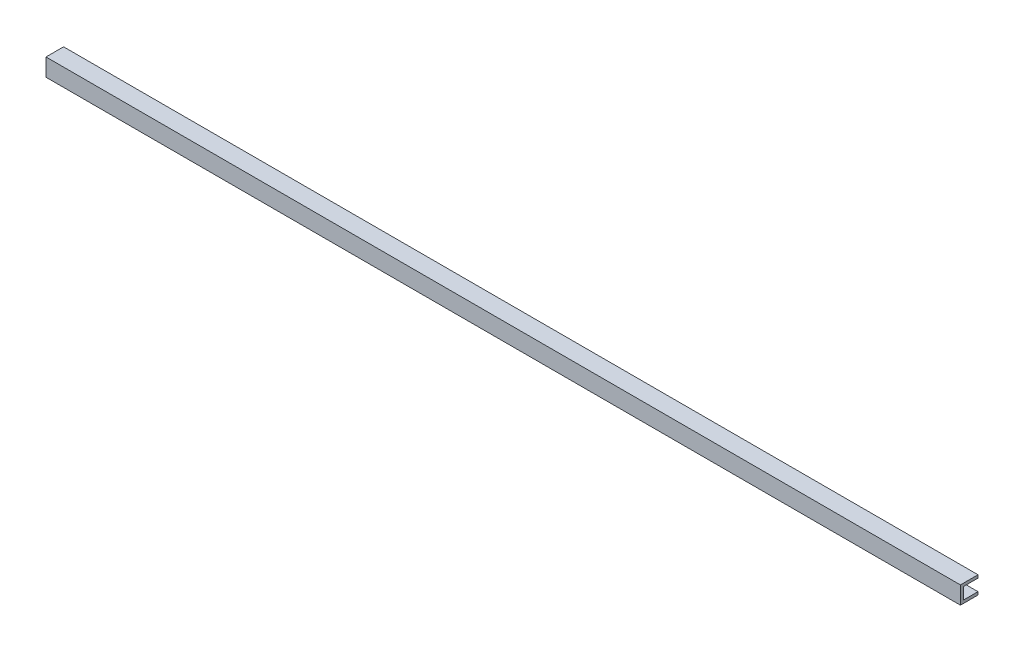
ISO-10303-21;
HEADER;
FILE_DESCRIPTION(('STEP AP214'),'2;1');
FILE_NAME('part.step','',(''),(''),'','','');
FILE_SCHEMA(('AUTOMOTIVE_DESIGN { 1 0 10303 214 1 1 1 1 }'));
ENDSEC;
DATA;
#1=APPLICATION_CONTEXT('core data for automotive mechanical design processes');
#2=APPLICATION_PROTOCOL_DEFINITION('international standard','automotive_design',2000,#1);
#3=PRODUCT_CONTEXT('',#1,'mechanical');
#4=PRODUCT('Part','Part','',(#3));
#5=PRODUCT_RELATED_PRODUCT_CATEGORY('part','',(#4));
#6=PRODUCT_DEFINITION_FORMATION('','',#4);
#7=PRODUCT_DEFINITION_CONTEXT('part definition',#1,'design');
#8=PRODUCT_DEFINITION('design','',#6,#7);
#9=PRODUCT_DEFINITION_SHAPE('','',#8);
#10=(LENGTH_UNIT() NAMED_UNIT(*) SI_UNIT(.MILLI.,.METRE.));
#11=(NAMED_UNIT(*) PLANE_ANGLE_UNIT() SI_UNIT($,.RADIAN.));
#12=(NAMED_UNIT(*) SI_UNIT($,.STERADIAN.) SOLID_ANGLE_UNIT());
#13=UNCERTAINTY_MEASURE_WITH_UNIT(LENGTH_MEASURE(1.E-05),#10,'distance_accuracy_value','');
#14=(GEOMETRIC_REPRESENTATION_CONTEXT(3) GLOBAL_UNCERTAINTY_ASSIGNED_CONTEXT((#13)) GLOBAL_UNIT_ASSIGNED_CONTEXT((#10,
#11,#12)) REPRESENTATION_CONTEXT('',''));
#15=CARTESIAN_POINT('',(0.,0.,0.));
#16=DIRECTION('',(0.,0.,1.));
#17=DIRECTION('',(1.,0.,0.));
#18=AXIS2_PLACEMENT_3D('',#15,#16,#17);
#19=CARTESIAN_POINT('',(-495.3,-9.525,0.));
#20=DIRECTION('',(0.,-1.,0.));
#21=DIRECTION('',(0.,0.,-1.));
#22=AXIS2_PLACEMENT_3D('',#19,#20,#21);
#23=PLANE('',#22);
#24=DIRECTION('',(1.,0.,0.));
#25=VECTOR('',#24,1.);
#26=CARTESIAN_POINT('',(-495.3,-9.525,0.));
#27=LINE('',#26,#25);
#28=CARTESIAN_POINT('',(-495.3,-9.525,0.));
#29=VERTEX_POINT('',#28);
#30=CARTESIAN_POINT('',(495.3,-9.525,0.));
#31=VERTEX_POINT('',#30);
#32=EDGE_CURVE('E83',#29,#31,#27,.T.);
#33=ORIENTED_EDGE('',*,*,#32,.F.);
#34=DIRECTION('',(0.,0.,-1.));
#35=VECTOR('',#34,1.);
#36=CARTESIAN_POINT('',(-495.3,-9.525,0.));
#37=LINE('',#36,#35);
#38=CARTESIAN_POINT('',(-495.3,-9.525,-19.05));
#39=VERTEX_POINT('',#38);
#40=EDGE_CURVE('E122',#29,#39,#37,.T.);
#41=ORIENTED_EDGE('',*,*,#40,.T.);
#42=DIRECTION('',(-1.,0.,0.));
#43=VECTOR('',#42,1.);
#44=CARTESIAN_POINT('',(-495.3,-9.525,-19.05));
#45=LINE('',#44,#43);
#46=CARTESIAN_POINT('',(495.3,-9.525,-19.05));
#47=VERTEX_POINT('',#46);
#48=EDGE_CURVE('E19',#47,#39,#45,.T.);
#49=ORIENTED_EDGE('',*,*,#48,.F.);
#50=DIRECTION('',(0.,0.,-1.));
#51=VECTOR('',#50,1.);
#52=CARTESIAN_POINT('',(495.3,-9.525,0.));
#53=LINE('',#52,#51);
#54=EDGE_CURVE('E94',#31,#47,#53,.T.);
#55=ORIENTED_EDGE('',*,*,#54,.F.);
#56=EDGE_LOOP('',(#33,#41,#49,#55));
#57=FACE_BOUND('',#56,.T.);
#58=ADVANCED_FACE('F16',(#57),#23,.T.);
#59=CARTESIAN_POINT('',(-495.3,-9.525,-19.05));
#60=DIRECTION('',(0.,0.,-1.));
#61=DIRECTION('',(-1.,0.,0.));
#62=AXIS2_PLACEMENT_3D('',#59,#60,#61);
#63=PLANE('',#62);
#64=ORIENTED_EDGE('',*,*,#48,.T.);
#65=DIRECTION('',(0.,1.,0.));
#66=VECTOR('',#65,1.);
#67=CARTESIAN_POINT('',(-495.3,0.,-19.05));
#68=LINE('',#67,#66);
#69=CARTESIAN_POINT('',(-495.3,-6.35,-19.05));
#70=VERTEX_POINT('',#69);
#71=EDGE_CURVE('E118',#39,#70,#68,.T.);
#72=ORIENTED_EDGE('',*,*,#71,.T.);
#73=DIRECTION('',(1.,0.,0.));
#74=VECTOR('',#73,1.);
#75=CARTESIAN_POINT('',(-495.3,-6.35,-19.05));
#76=LINE('',#75,#74);
#77=CARTESIAN_POINT('',(495.3,-6.35,-19.05));
#78=VERTEX_POINT('',#77);
#79=EDGE_CURVE('E110',#78,#70,#76,.F.);
#80=ORIENTED_EDGE('',*,*,#79,.F.);
#81=DIRECTION('',(0.,1.,0.));
#82=VECTOR('',#81,1.);
#83=CARTESIAN_POINT('',(495.3,0.,-19.05));
#84=LINE('',#83,#82);
#85=EDGE_CURVE('E97',#47,#78,#84,.T.);
#86=ORIENTED_EDGE('',*,*,#85,.F.);
#87=EDGE_LOOP('',(#64,#72,#80,#86));
#88=FACE_BOUND('',#87,.T.);
#89=ADVANCED_FACE('F117',(#88),#63,.T.);
#90=CARTESIAN_POINT('',(-495.3,-6.35,-19.05));
#91=DIRECTION('',(0.,1.,0.));
#92=DIRECTION('',(0.,0.,1.));
#93=AXIS2_PLACEMENT_3D('',#90,#91,#92);
#94=PLANE('',#93);
#95=ORIENTED_EDGE('',*,*,#79,.T.);
#96=DIRECTION('',(0.,0.,-1.));
#97=VECTOR('',#96,1.);
#98=CARTESIAN_POINT('',(-495.3,-6.35,0.));
#99=LINE('',#98,#97);
#100=CARTESIAN_POINT('',(-495.3,-6.35,-3.175));
#101=VERTEX_POINT('',#100);
#102=EDGE_CURVE('E124',#70,#101,#99,.F.);
#103=ORIENTED_EDGE('',*,*,#102,.T.);
#104=DIRECTION('',(-1.,0.,0.));
#105=VECTOR('',#104,1.);
#106=CARTESIAN_POINT('',(-495.3,-6.35,-3.175));
#107=LINE('',#106,#105);
#108=CARTESIAN_POINT('',(495.3,-6.35,-3.175));
#109=VERTEX_POINT('',#108);
#110=EDGE_CURVE('E108',#109,#101,#107,.T.);
#111=ORIENTED_EDGE('',*,*,#110,.F.);
#112=DIRECTION('',(0.,0.,-1.));
#113=VECTOR('',#112,1.);
#114=CARTESIAN_POINT('',(495.3,-6.35,0.));
#115=LINE('',#114,#113);
#116=EDGE_CURVE('E142',#78,#109,#115,.F.);
#117=ORIENTED_EDGE('',*,*,#116,.F.);
#118=EDGE_LOOP('',(#95,#103,#111,#117));
#119=FACE_BOUND('',#118,.T.);
#120=ADVANCED_FACE('F145',(#119),#94,.T.);
#121=CARTESIAN_POINT('',(-495.3,-6.35,-3.175));
#122=DIRECTION('',(0.,0.,-1.));
#123=DIRECTION('',(-1.,0.,0.));
#124=AXIS2_PLACEMENT_3D('',#121,#122,#123);
#125=PLANE('',#124);
#126=ORIENTED_EDGE('',*,*,#110,.T.);
#127=DIRECTION('',(0.,1.,0.));
#128=VECTOR('',#127,1.);
#129=CARTESIAN_POINT('',(-495.3,0.,-3.175));
#130=LINE('',#129,#128);
#131=CARTESIAN_POINT('',(-495.3,6.35,-3.175));
#132=VERTEX_POINT('',#131);
#133=EDGE_CURVE('E126',#101,#132,#130,.T.);
#134=ORIENTED_EDGE('',*,*,#133,.T.);
#135=DIRECTION('',(1.,0.,0.));
#136=VECTOR('',#135,1.);
#137=CARTESIAN_POINT('',(-495.3,6.35,-3.175));
#138=LINE('',#137,#136);
#139=CARTESIAN_POINT('',(495.3,6.35,-3.175));
#140=VERTEX_POINT('',#139);
#141=EDGE_CURVE('E91',#140,#132,#138,.F.);
#142=ORIENTED_EDGE('',*,*,#141,.F.);
#143=DIRECTION('',(0.,1.,0.));
#144=VECTOR('',#143,1.);
#145=CARTESIAN_POINT('',(495.3,0.,-3.175));
#146=LINE('',#145,#144);
#147=EDGE_CURVE('E139',#109,#140,#146,.T.);
#148=ORIENTED_EDGE('',*,*,#147,.F.);
#149=EDGE_LOOP('',(#126,#134,#142,#148));
#150=FACE_BOUND('',#149,.T.);
#151=ADVANCED_FACE('F147',(#150),#125,.T.);
#152=CARTESIAN_POINT('',(-495.3,6.35,-3.175));
#153=DIRECTION('',(0.,-1.,0.));
#154=DIRECTION('',(0.,0.,-1.));
#155=AXIS2_PLACEMENT_3D('',#152,#153,#154);
#156=PLANE('',#155);
#157=ORIENTED_EDGE('',*,*,#141,.T.);
#158=DIRECTION('',(0.,0.,-1.));
#159=VECTOR('',#158,1.);
#160=CARTESIAN_POINT('',(-495.3,6.35,0.));
#161=LINE('',#160,#159);
#162=CARTESIAN_POINT('',(-495.3,6.35,-19.05));
#163=VERTEX_POINT('',#162);
#164=EDGE_CURVE('E162',#132,#163,#161,.T.);
#165=ORIENTED_EDGE('',*,*,#164,.T.);
#166=DIRECTION('',(-1.,0.,0.));
#167=VECTOR('',#166,1.);
#168=CARTESIAN_POINT('',(-495.3,6.35,-19.05));
#169=LINE('',#168,#167);
#170=CARTESIAN_POINT('',(495.3,6.35,-19.05));
#171=VERTEX_POINT('',#170);
#172=EDGE_CURVE('E132',#171,#163,#169,.T.);
#173=ORIENTED_EDGE('',*,*,#172,.F.);
#174=DIRECTION('',(0.,0.,-1.));
#175=VECTOR('',#174,1.);
#176=CARTESIAN_POINT('',(495.3,6.35,0.));
#177=LINE('',#176,#175);
#178=EDGE_CURVE('E137',#140,#171,#177,.T.);
#179=ORIENTED_EDGE('',*,*,#178,.F.);
#180=EDGE_LOOP('',(#157,#165,#173,#179));
#181=FACE_BOUND('',#180,.T.);
#182=ADVANCED_FACE('F151',(#181),#156,.T.);
#183=CARTESIAN_POINT('',(-495.3,9.525,0.));
#184=DIRECTION('',(0.,0.,1.));
#185=DIRECTION('',(1.,0.,0.));
#186=AXIS2_PLACEMENT_3D('',#183,#184,#185);
#187=PLANE('',#186);
#188=DIRECTION('',(1.,0.,0.));
#189=VECTOR('',#188,1.);
#190=CARTESIAN_POINT('',(-495.3,9.525,0.));
#191=LINE('',#190,#189);
#192=CARTESIAN_POINT('',(-495.3,9.525,0.));
#193=VERTEX_POINT('',#192);
#194=CARTESIAN_POINT('',(495.3,9.525,0.));
#195=VERTEX_POINT('',#194);
#196=EDGE_CURVE('E157',#193,#195,#191,.T.);
#197=ORIENTED_EDGE('',*,*,#196,.F.);
#198=DIRECTION('',(0.,1.,0.));
#199=VECTOR('',#198,1.);
#200=CARTESIAN_POINT('',(-495.3,0.,0.));
#201=LINE('',#200,#199);
#202=EDGE_CURVE('E89',#193,#29,#201,.F.);
#203=ORIENTED_EDGE('',*,*,#202,.T.);
#204=ORIENTED_EDGE('',*,*,#32,.T.);
#205=DIRECTION('',(0.,1.,0.));
#206=VECTOR('',#205,1.);
#207=CARTESIAN_POINT('',(495.3,0.,0.));
#208=LINE('',#207,#206);
#209=EDGE_CURVE('E86',#195,#31,#208,.F.);
#210=ORIENTED_EDGE('',*,*,#209,.F.);
#211=EDGE_LOOP('',(#197,#203,#204,#210));
#212=FACE_BOUND('',#211,.T.);
#213=ADVANCED_FACE('F84',(#212),#187,.T.);
#214=CARTESIAN_POINT('',(495.3,0.,0.));
#215=DIRECTION('',(1.,0.,0.));
#216=DIRECTION('',(0.,0.,-1.));
#217=AXIS2_PLACEMENT_3D('',#214,#215,#216);
#218=PLANE('',#217);
#219=DIRECTION('',(0.,1.,0.));
#220=VECTOR('',#219,1.);
#221=CARTESIAN_POINT('',(495.3,6.35,-19.05));
#222=LINE('',#221,#220);
#223=CARTESIAN_POINT('',(495.3,9.525,-19.05));
#224=VERTEX_POINT('',#223);
#225=EDGE_CURVE('E134',#224,#171,#222,.F.);
#226=ORIENTED_EDGE('',*,*,#225,.F.);
#227=DIRECTION('',(0.,0.,1.));
#228=VECTOR('',#227,1.);
#229=CARTESIAN_POINT('',(495.3,9.525,-19.05));
#230=LINE('',#229,#228);
#231=EDGE_CURVE('E101',#195,#224,#230,.F.);
#232=ORIENTED_EDGE('',*,*,#231,.F.);
#233=ORIENTED_EDGE('',*,*,#209,.T.);
#234=ORIENTED_EDGE('',*,*,#54,.T.);
#235=ORIENTED_EDGE('',*,*,#85,.T.);
#236=ORIENTED_EDGE('',*,*,#116,.T.);
#237=ORIENTED_EDGE('',*,*,#147,.T.);
#238=ORIENTED_EDGE('',*,*,#178,.T.);
#239=EDGE_LOOP('',(#226,#232,#233,#234,#235,#236,#237,#238));
#240=FACE_BOUND('',#239,.T.);
#241=ADVANCED_FACE('F99',(#240),#218,.T.);
#242=CARTESIAN_POINT('',(-495.3,6.35,-19.05));
#243=DIRECTION('',(0.,0.,-1.));
#244=DIRECTION('',(-1.,0.,0.));
#245=AXIS2_PLACEMENT_3D('',#242,#243,#244);
#246=PLANE('',#245);
#247=ORIENTED_EDGE('',*,*,#172,.T.);
#248=DIRECTION('',(0.,1.,0.));
#249=VECTOR('',#248,1.);
#250=CARTESIAN_POINT('',(-495.3,0.,-19.05));
#251=LINE('',#250,#249);
#252=CARTESIAN_POINT('',(-495.3,9.525,-19.05));
#253=VERTEX_POINT('',#252);
#254=EDGE_CURVE('E34',#163,#253,#251,.T.);
#255=ORIENTED_EDGE('',*,*,#254,.T.);
#256=DIRECTION('',(1.,0.,0.));
#257=VECTOR('',#256,1.);
#258=CARTESIAN_POINT('',(-495.3,9.525,-19.05));
#259=LINE('',#258,#257);
#260=EDGE_CURVE('E25',#224,#253,#259,.F.);
#261=ORIENTED_EDGE('',*,*,#260,.F.);
#262=ORIENTED_EDGE('',*,*,#225,.T.);
#263=EDGE_LOOP('',(#247,#255,#261,#262));
#264=FACE_BOUND('',#263,.T.);
#265=ADVANCED_FACE('F153',(#264),#246,.T.);
#266=CARTESIAN_POINT('',(-495.3,0.,0.));
#267=DIRECTION('',(1.,0.,0.));
#268=DIRECTION('',(0.,0.,-1.));
#269=AXIS2_PLACEMENT_3D('',#266,#267,#268);
#270=PLANE('',#269);
#271=ORIENTED_EDGE('',*,*,#164,.F.);
#272=ORIENTED_EDGE('',*,*,#133,.F.);
#273=ORIENTED_EDGE('',*,*,#102,.F.);
#274=ORIENTED_EDGE('',*,*,#71,.F.);
#275=ORIENTED_EDGE('',*,*,#40,.F.);
#276=ORIENTED_EDGE('',*,*,#202,.F.);
#277=DIRECTION('',(0.,0.,1.));
#278=VECTOR('',#277,1.);
#279=CARTESIAN_POINT('',(-495.3,9.525,-19.05));
#280=LINE('',#279,#278);
#281=EDGE_CURVE('E11',#253,#193,#280,.T.);
#282=ORIENTED_EDGE('',*,*,#281,.F.);
#283=ORIENTED_EDGE('',*,*,#254,.F.);
#284=EDGE_LOOP('',(#271,#272,#273,#274,#275,#276,#282,#283));
#285=FACE_BOUND('',#284,.T.);
#286=ADVANCED_FACE('F121',(#285),#270,.F.);
#287=CARTESIAN_POINT('',(-495.3,9.525,-19.05));
#288=DIRECTION('',(0.,1.,0.));
#289=DIRECTION('',(0.,0.,1.));
#290=AXIS2_PLACEMENT_3D('',#287,#288,#289);
#291=PLANE('',#290);
#292=ORIENTED_EDGE('',*,*,#260,.T.);
#293=ORIENTED_EDGE('',*,*,#281,.T.);
#294=ORIENTED_EDGE('',*,*,#196,.T.);
#295=ORIENTED_EDGE('',*,*,#231,.T.);
#296=EDGE_LOOP('',(#292,#293,#294,#295));
#297=FACE_BOUND('',#296,.T.);
#298=ADVANCED_FACE('F156',(#297),#291,.T.);
#299=CLOSED_SHELL('',(#58,#89,#120,#151,#182,#213,#241,#265,#286,#298));
#300=MANIFOLD_SOLID_BREP('B1',#299);
#301=ADVANCED_BREP_SHAPE_REPRESENTATION('',(#18,#300),#14);
#302=SHAPE_DEFINITION_REPRESENTATION(#9,#301);
ENDSEC;
END-ISO-10303-21;
